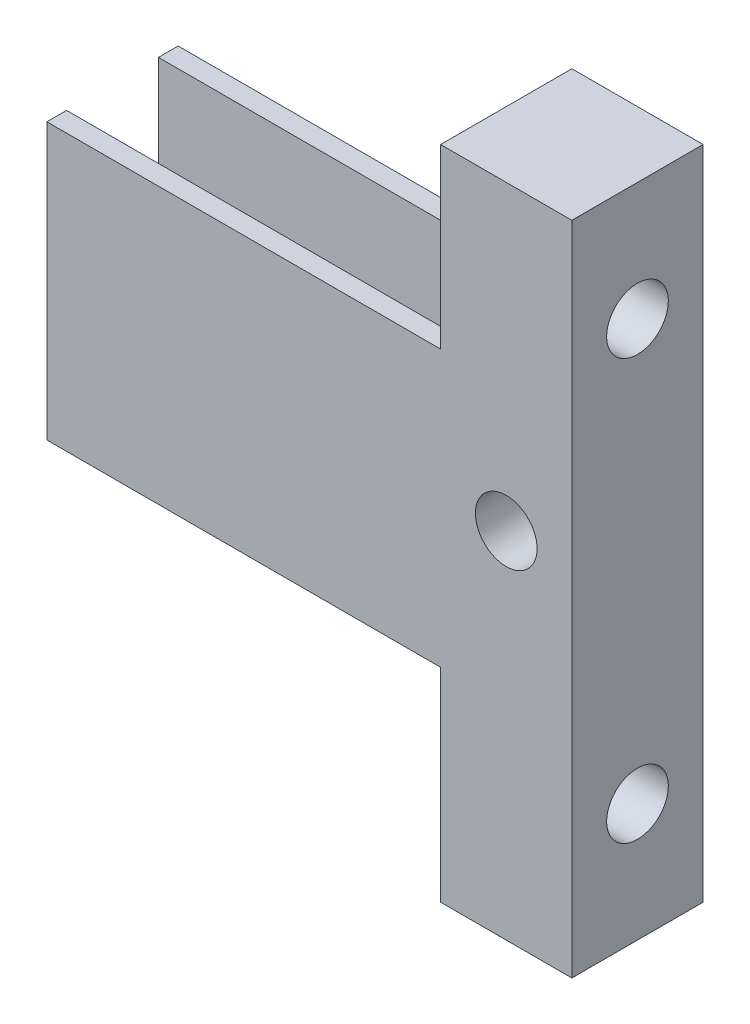
ISO-10303-21;
HEADER;
FILE_DESCRIPTION(('STEP AP214'),'2;1');
FILE_NAME('part.step','',(''),(''),'','','');
FILE_SCHEMA(('AUTOMOTIVE_DESIGN { 1 0 10303 214 1 1 1 1 }'));
ENDSEC;
DATA;
#1=APPLICATION_CONTEXT('core data for automotive mechanical design processes');
#2=APPLICATION_PROTOCOL_DEFINITION('international standard','automotive_design',2000,#1);
#3=PRODUCT_CONTEXT('',#1,'mechanical');
#4=PRODUCT('Part','Part','',(#3));
#5=PRODUCT_RELATED_PRODUCT_CATEGORY('part','',(#4));
#6=PRODUCT_DEFINITION_FORMATION('','',#4);
#7=PRODUCT_DEFINITION_CONTEXT('part definition',#1,'design');
#8=PRODUCT_DEFINITION('design','',#6,#7);
#9=PRODUCT_DEFINITION_SHAPE('','',#8);
#10=(LENGTH_UNIT() NAMED_UNIT(*) SI_UNIT(.MILLI.,.METRE.));
#11=(NAMED_UNIT(*) PLANE_ANGLE_UNIT() SI_UNIT($,.RADIAN.));
#12=(NAMED_UNIT(*) SI_UNIT($,.STERADIAN.) SOLID_ANGLE_UNIT());
#13=UNCERTAINTY_MEASURE_WITH_UNIT(LENGTH_MEASURE(1.E-05),#10,'distance_accuracy_value','');
#14=(GEOMETRIC_REPRESENTATION_CONTEXT(3) GLOBAL_UNCERTAINTY_ASSIGNED_CONTEXT((#13)) GLOBAL_UNIT_ASSIGNED_CONTEXT((#10,
#11,#12)) REPRESENTATION_CONTEXT('',''));
#15=CARTESIAN_POINT('',(0.,0.,0.));
#16=DIRECTION('',(0.,0.,1.));
#17=DIRECTION('',(1.,0.,0.));
#18=AXIS2_PLACEMENT_3D('',#15,#16,#17);
#19=CARTESIAN_POINT('',(0.,0.,10.));
#20=DIRECTION('',(-1.,0.,0.));
#21=DIRECTION('',(0.,-1.,0.));
#22=AXIS2_PLACEMENT_3D('',#19,#20,#21);
#23=PLANE('',#22);
#24=CARTESIAN_POINT('',(0.,41.,5.));
#25=DIRECTION('',(-1.,0.,0.));
#26=DIRECTION('',(0.,-1.,0.));
#27=AXIS2_PLACEMENT_3D('',#24,#25,#26);
#28=CIRCLE('',#27,2.35);
#29=CARTESIAN_POINT('',(0.,38.65,5.));
#30=VERTEX_POINT('',#29);
#31=EDGE_CURVE('E182',#30,#30,#28,.T.);
#32=ORIENTED_EDGE('',*,*,#31,.F.);
#33=EDGE_LOOP('',(#32));
#34=FACE_BOUND('',#33,.T.);
#35=CARTESIAN_POINT('',(0.,9.,5.));
#36=DIRECTION('',(-1.,0.,0.));
#37=DIRECTION('',(0.,-1.,0.));
#38=AXIS2_PLACEMENT_3D('',#35,#36,#37);
#39=CIRCLE('',#38,2.35);
#40=CARTESIAN_POINT('',(0.,6.65,5.));
#41=VERTEX_POINT('',#40);
#42=EDGE_CURVE('E177',#41,#41,#39,.T.);
#43=ORIENTED_EDGE('',*,*,#42,.F.);
#44=EDGE_LOOP('',(#43));
#45=FACE_BOUND('',#44,.T.);
#46=DIRECTION('',(0.,1.,0.));
#47=VECTOR('',#46,1.);
#48=CARTESIAN_POINT('',(0.,0.,0.));
#49=LINE('',#48,#47);
#50=CARTESIAN_POINT('',(0.,36.5,0.));
#51=VERTEX_POINT('',#50);
#52=CARTESIAN_POINT('',(0.,50.,0.));
#53=VERTEX_POINT('',#52);
#54=EDGE_CURVE('E213',#51,#53,#49,.T.);
#55=ORIENTED_EDGE('',*,*,#54,.F.);
#56=DIRECTION('',(0.,0.,-1.));
#57=VECTOR('',#56,1.);
#58=CARTESIAN_POINT('',(0.,36.5,0.));
#59=LINE('',#58,#57);
#60=CARTESIAN_POINT('',(0.,36.5,1.5));
#61=VERTEX_POINT('',#60);
#62=EDGE_CURVE('E50',#61,#51,#59,.T.);
#63=ORIENTED_EDGE('',*,*,#62,.F.);
#64=DIRECTION('',(0.,1.,0.));
#65=VECTOR('',#64,1.);
#66=CARTESIAN_POINT('',(0.,36.5,1.5));
#67=LINE('',#66,#65);
#68=CARTESIAN_POINT('',(0.,15.5,1.5));
#69=VERTEX_POINT('',#68);
#70=EDGE_CURVE('E142',#69,#61,#67,.T.);
#71=ORIENTED_EDGE('',*,*,#70,.F.);
#72=DIRECTION('',(0.,0.,1.));
#73=VECTOR('',#72,1.);
#74=CARTESIAN_POINT('',(0.,15.5,1.5));
#75=LINE('',#74,#73);
#76=CARTESIAN_POINT('',(0.,15.5,0.));
#77=VERTEX_POINT('',#76);
#78=EDGE_CURVE('E398',#77,#69,#75,.T.);
#79=ORIENTED_EDGE('',*,*,#78,.F.);
#80=CARTESIAN_POINT('',(0.,0.,0.));
#81=VERTEX_POINT('',#80);
#82=EDGE_CURVE('E214',#81,#77,#49,.T.);
#83=ORIENTED_EDGE('',*,*,#82,.F.);
#84=DIRECTION('',(0.,0.,-1.));
#85=VECTOR('',#84,1.);
#86=CARTESIAN_POINT('',(0.,0.,10.));
#87=LINE('',#86,#85);
#88=CARTESIAN_POINT('',(0.,0.,10.));
#89=VERTEX_POINT('',#88);
#90=EDGE_CURVE('E219',#89,#81,#87,.T.);
#91=ORIENTED_EDGE('',*,*,#90,.F.);
#92=DIRECTION('',(0.,1.,0.));
#93=VECTOR('',#92,1.);
#94=CARTESIAN_POINT('',(0.,0.,10.));
#95=LINE('',#94,#93);
#96=CARTESIAN_POINT('',(0.,15.5,10.));
#97=VERTEX_POINT('',#96);
#98=EDGE_CURVE('E204',#89,#97,#95,.T.);
#99=ORIENTED_EDGE('',*,*,#98,.T.);
#100=DIRECTION('',(0.,0.,1.));
#101=VECTOR('',#100,1.);
#102=CARTESIAN_POINT('',(0.,15.5,8.5));
#103=LINE('',#102,#101);
#104=CARTESIAN_POINT('',(0.,15.5,8.5));
#105=VERTEX_POINT('',#104);
#106=EDGE_CURVE('E157',#105,#97,#103,.T.);
#107=ORIENTED_EDGE('',*,*,#106,.F.);
#108=DIRECTION('',(0.,-1.,0.));
#109=VECTOR('',#108,1.);
#110=CARTESIAN_POINT('',(0.,36.5,8.5));
#111=LINE('',#110,#109);
#112=CARTESIAN_POINT('',(0.,36.5,8.5));
#113=VERTEX_POINT('',#112);
#114=EDGE_CURVE('E58',#113,#105,#111,.T.);
#115=ORIENTED_EDGE('',*,*,#114,.F.);
#116=DIRECTION('',(0.,0.,-1.));
#117=VECTOR('',#116,1.);
#118=CARTESIAN_POINT('',(0.,36.5,10.));
#119=LINE('',#118,#117);
#120=CARTESIAN_POINT('',(0.,36.5,10.));
#121=VERTEX_POINT('',#120);
#122=EDGE_CURVE('E145',#121,#113,#119,.T.);
#123=ORIENTED_EDGE('',*,*,#122,.F.);
#124=CARTESIAN_POINT('',(0.,50.,10.));
#125=VERTEX_POINT('',#124);
#126=EDGE_CURVE('E203',#121,#125,#95,.T.);
#127=ORIENTED_EDGE('',*,*,#126,.T.);
#128=DIRECTION('',(0.,0.,-1.));
#129=VECTOR('',#128,1.);
#130=CARTESIAN_POINT('',(0.,50.,10.));
#131=LINE('',#130,#129);
#132=EDGE_CURVE('E42',#125,#53,#131,.T.);
#133=ORIENTED_EDGE('',*,*,#132,.T.);
#134=EDGE_LOOP('',(#55,#63,#71,#79,#83,#91,#99,#107,#115,#123,#127,#133));
#135=FACE_BOUND('',#134,.T.);
#136=ADVANCED_FACE('F33',(#34,#45,#135),#23,.T.);
#137=CARTESIAN_POINT('',(9.99999999999999,50.,10.));
#138=DIRECTION('',(1.,0.,0.));
#139=DIRECTION('',(0.,1.,0.));
#140=AXIS2_PLACEMENT_3D('',#137,#138,#139);
#141=PLANE('',#140);
#142=CARTESIAN_POINT('',(10.,41.,5.));
#143=DIRECTION('',(-1.,0.,0.));
#144=DIRECTION('',(0.,-1.,0.));
#145=AXIS2_PLACEMENT_3D('',#142,#143,#144);
#146=CIRCLE('',#145,2.35);
#147=CARTESIAN_POINT('',(10.,38.65,5.));
#148=VERTEX_POINT('',#147);
#149=EDGE_CURVE('E178',#148,#148,#146,.T.);
#150=ORIENTED_EDGE('',*,*,#149,.T.);
#151=EDGE_LOOP('',(#150));
#152=FACE_BOUND('',#151,.T.);
#153=CARTESIAN_POINT('',(10.,9.,5.));
#154=DIRECTION('',(-1.,0.,0.));
#155=DIRECTION('',(0.,-1.,0.));
#156=AXIS2_PLACEMENT_3D('',#153,#154,#155);
#157=CIRCLE('',#156,2.35);
#158=CARTESIAN_POINT('',(10.,6.65,5.));
#159=VERTEX_POINT('',#158);
#160=EDGE_CURVE('E185',#159,#159,#157,.T.);
#161=ORIENTED_EDGE('',*,*,#160,.T.);
#162=EDGE_LOOP('',(#161));
#163=FACE_BOUND('',#162,.T.);
#164=DIRECTION('',(0.,-1.,0.));
#165=VECTOR('',#164,1.);
#166=CARTESIAN_POINT('',(9.99999999999999,50.,0.));
#167=LINE('',#166,#165);
#168=CARTESIAN_POINT('',(9.99999999999999,50.,0.));
#169=VERTEX_POINT('',#168);
#170=CARTESIAN_POINT('',(10.,0.,0.));
#171=VERTEX_POINT('',#170);
#172=EDGE_CURVE('E193',#169,#171,#167,.T.);
#173=ORIENTED_EDGE('',*,*,#172,.F.);
#174=DIRECTION('',(0.,0.,-1.));
#175=VECTOR('',#174,1.);
#176=CARTESIAN_POINT('',(9.99999999999999,50.,10.));
#177=LINE('',#176,#175);
#178=CARTESIAN_POINT('',(9.99999999999999,50.,10.));
#179=VERTEX_POINT('',#178);
#180=EDGE_CURVE('E11',#179,#169,#177,.T.);
#181=ORIENTED_EDGE('',*,*,#180,.F.);
#182=DIRECTION('',(0.,-1.,0.));
#183=VECTOR('',#182,1.);
#184=CARTESIAN_POINT('',(9.99999999999999,50.,10.));
#185=LINE('',#184,#183);
#186=CARTESIAN_POINT('',(10.,0.,10.));
#187=VERTEX_POINT('',#186);
#188=EDGE_CURVE('E196',#179,#187,#185,.T.);
#189=ORIENTED_EDGE('',*,*,#188,.T.);
#190=DIRECTION('',(0.,0.,-1.));
#191=VECTOR('',#190,1.);
#192=CARTESIAN_POINT('',(10.,0.,10.));
#193=LINE('',#192,#191);
#194=EDGE_CURVE('E37',#187,#171,#193,.T.);
#195=ORIENTED_EDGE('',*,*,#194,.T.);
#196=EDGE_LOOP('',(#173,#181,#189,#195));
#197=FACE_BOUND('',#196,.T.);
#198=ADVANCED_FACE('F35',(#152,#163,#197),#141,.T.);
#199=CARTESIAN_POINT('',(0.,50.,10.));
#200=DIRECTION('',(0.,1.,0.));
#201=DIRECTION('',(0.,0.,1.));
#202=AXIS2_PLACEMENT_3D('',#199,#200,#201);
#203=PLANE('',#202);
#204=DIRECTION('',(1.,0.,0.));
#205=VECTOR('',#204,1.);
#206=CARTESIAN_POINT('',(0.,50.,0.));
#207=LINE('',#206,#205);
#208=EDGE_CURVE('E200',#53,#169,#207,.T.);
#209=ORIENTED_EDGE('',*,*,#208,.F.);
#210=ORIENTED_EDGE('',*,*,#132,.F.);
#211=DIRECTION('',(1.,0.,0.));
#212=VECTOR('',#211,1.);
#213=CARTESIAN_POINT('',(0.,50.,10.));
#214=LINE('',#213,#212);
#215=EDGE_CURVE('E206',#125,#179,#214,.T.);
#216=ORIENTED_EDGE('',*,*,#215,.T.);
#217=ORIENTED_EDGE('',*,*,#180,.T.);
#218=EDGE_LOOP('',(#209,#210,#216,#217));
#219=FACE_BOUND('',#218,.T.);
#220=ADVANCED_FACE('F231',(#219),#203,.T.);
#221=CARTESIAN_POINT('',(10.,0.,10.));
#222=DIRECTION('',(0.,-1.,0.));
#223=DIRECTION('',(1.,0.,0.));
#224=AXIS2_PLACEMENT_3D('',#221,#222,#223);
#225=PLANE('',#224);
#226=DIRECTION('',(-1.,0.,0.));
#227=VECTOR('',#226,1.);
#228=CARTESIAN_POINT('',(10.,0.,0.));
#229=LINE('',#228,#227);
#230=EDGE_CURVE('E210',#171,#81,#229,.T.);
#231=ORIENTED_EDGE('',*,*,#230,.F.);
#232=ORIENTED_EDGE('',*,*,#194,.F.);
#233=DIRECTION('',(-1.,0.,0.));
#234=VECTOR('',#233,1.);
#235=CARTESIAN_POINT('',(10.,0.,10.));
#236=LINE('',#235,#234);
#237=EDGE_CURVE('E199',#187,#89,#236,.T.);
#238=ORIENTED_EDGE('',*,*,#237,.T.);
#239=ORIENTED_EDGE('',*,*,#90,.T.);
#240=EDGE_LOOP('',(#231,#232,#238,#239));
#241=FACE_BOUND('',#240,.T.);
#242=ADVANCED_FACE('F227',(#241),#225,.T.);
#243=CARTESIAN_POINT('',(0.,0.,10.));
#244=DIRECTION('',(0.,0.,-1.));
#245=DIRECTION('',(-1.,0.,0.));
#246=AXIS2_PLACEMENT_3D('',#243,#244,#245);
#247=PLANE('',#246);
#248=CARTESIAN_POINT('',(4.99999999999999,27.,10.));
#249=DIRECTION('',(0.,0.,1.));
#250=DIRECTION('',(1.,0.,0.));
#251=AXIS2_PLACEMENT_3D('',#248,#249,#250);
#252=CIRCLE('',#251,2.35);
#253=CARTESIAN_POINT('',(7.34999999999999,27.,10.));
#254=VERTEX_POINT('',#253);
#255=EDGE_CURVE('E181',#254,#254,#252,.T.);
#256=ORIENTED_EDGE('',*,*,#255,.F.);
#257=EDGE_LOOP('',(#256));
#258=FACE_BOUND('',#257,.T.);
#259=ORIENTED_EDGE('',*,*,#188,.F.);
#260=ORIENTED_EDGE('',*,*,#215,.F.);
#261=ORIENTED_EDGE('',*,*,#126,.F.);
#262=DIRECTION('',(1.,0.,0.));
#263=VECTOR('',#262,1.);
#264=CARTESIAN_POINT('',(-30.,36.5,10.));
#265=LINE('',#264,#263);
#266=CARTESIAN_POINT('',(-30.,36.5,10.));
#267=VERTEX_POINT('',#266);
#268=EDGE_CURVE('E162',#267,#121,#265,.T.);
#269=ORIENTED_EDGE('',*,*,#268,.F.);
#270=DIRECTION('',(0.,1.,0.));
#271=VECTOR('',#270,1.);
#272=CARTESIAN_POINT('',(-30.,15.5,10.));
#273=LINE('',#272,#271);
#274=CARTESIAN_POINT('',(-30.,15.5,10.));
#275=VERTEX_POINT('',#274);
#276=EDGE_CURVE('E161',#275,#267,#273,.T.);
#277=ORIENTED_EDGE('',*,*,#276,.F.);
#278=DIRECTION('',(1.,0.,0.));
#279=VECTOR('',#278,1.);
#280=CARTESIAN_POINT('',(-30.,15.5,10.));
#281=LINE('',#280,#279);
#282=EDGE_CURVE('E169',#275,#97,#281,.T.);
#283=ORIENTED_EDGE('',*,*,#282,.T.);
#284=ORIENTED_EDGE('',*,*,#98,.F.);
#285=ORIENTED_EDGE('',*,*,#237,.F.);
#286=EDGE_LOOP('',(#259,#260,#261,#269,#277,#283,#284,#285));
#287=FACE_BOUND('',#286,.T.);
#288=ADVANCED_FACE('F234',(#258,#287),#247,.F.);
#289=CARTESIAN_POINT('',(0.,0.,0.));
#290=DIRECTION('',(0.,0.,-1.));
#291=DIRECTION('',(-1.,0.,0.));
#292=AXIS2_PLACEMENT_3D('',#289,#290,#291);
#293=PLANE('',#292);
#294=CARTESIAN_POINT('',(4.99999999999999,27.,0.));
#295=DIRECTION('',(0.,0.,1.));
#296=DIRECTION('',(1.,0.,0.));
#297=AXIS2_PLACEMENT_3D('',#294,#295,#296);
#298=CIRCLE('',#297,2.35);
#299=CARTESIAN_POINT('',(7.34999999999999,27.,0.));
#300=VERTEX_POINT('',#299);
#301=EDGE_CURVE('E190',#300,#300,#298,.T.);
#302=ORIENTED_EDGE('',*,*,#301,.T.);
#303=EDGE_LOOP('',(#302));
#304=FACE_BOUND('',#303,.T.);
#305=ORIENTED_EDGE('',*,*,#172,.T.);
#306=ORIENTED_EDGE('',*,*,#230,.T.);
#307=ORIENTED_EDGE('',*,*,#82,.T.);
#308=DIRECTION('',(1.,0.,0.));
#309=VECTOR('',#308,1.);
#310=CARTESIAN_POINT('',(-30.,15.5,0.));
#311=LINE('',#310,#309);
#312=CARTESIAN_POINT('',(-30.,15.5,0.));
#313=VERTEX_POINT('',#312);
#314=EDGE_CURVE('E131',#313,#77,#311,.T.);
#315=ORIENTED_EDGE('',*,*,#314,.F.);
#316=DIRECTION('',(0.,-1.,0.));
#317=VECTOR('',#316,1.);
#318=CARTESIAN_POINT('',(-30.,15.5,0.));
#319=LINE('',#318,#317);
#320=CARTESIAN_POINT('',(-30.,36.5,0.));
#321=VERTEX_POINT('',#320);
#322=EDGE_CURVE('E124',#321,#313,#319,.T.);
#323=ORIENTED_EDGE('',*,*,#322,.F.);
#324=DIRECTION('',(1.,0.,0.));
#325=VECTOR('',#324,1.);
#326=CARTESIAN_POINT('',(-30.,36.5,0.));
#327=LINE('',#326,#325);
#328=EDGE_CURVE('E128',#321,#51,#327,.T.);
#329=ORIENTED_EDGE('',*,*,#328,.T.);
#330=ORIENTED_EDGE('',*,*,#54,.T.);
#331=ORIENTED_EDGE('',*,*,#208,.T.);
#332=EDGE_LOOP('',(#305,#306,#307,#315,#323,#329,#330,#331));
#333=FACE_BOUND('',#332,.T.);
#334=ADVANCED_FACE('F127',(#304,#333),#293,.T.);
#335=CARTESIAN_POINT('',(4.99999999999999,27.,0.));
#336=DIRECTION('',(0.,0.,1.));
#337=DIRECTION('',(1.,0.,0.));
#338=AXIS2_PLACEMENT_3D('',#335,#336,#337);
#339=CYLINDRICAL_SURFACE('',#338,2.35);
#340=ORIENTED_EDGE('',*,*,#301,.F.);
#341=EDGE_LOOP('',(#340));
#342=FACE_BOUND('',#341,.T.);
#343=ORIENTED_EDGE('',*,*,#255,.T.);
#344=EDGE_LOOP('',(#343));
#345=FACE_BOUND('',#344,.T.);
#346=ADVANCED_FACE('F291',(#342,#345),#339,.F.);
#347=CARTESIAN_POINT('',(10.,9.,5.));
#348=DIRECTION('',(-1.,0.,0.));
#349=DIRECTION('',(0.,-1.,0.));
#350=AXIS2_PLACEMENT_3D('',#347,#348,#349);
#351=CYLINDRICAL_SURFACE('',#350,2.35);
#352=ORIENTED_EDGE('',*,*,#160,.F.);
#353=EDGE_LOOP('',(#352));
#354=FACE_BOUND('',#353,.T.);
#355=ORIENTED_EDGE('',*,*,#42,.T.);
#356=EDGE_LOOP('',(#355));
#357=FACE_BOUND('',#356,.T.);
#358=ADVANCED_FACE('F295',(#354,#357),#351,.F.);
#359=CARTESIAN_POINT('',(10.,41.,5.));
#360=DIRECTION('',(-1.,0.,0.));
#361=DIRECTION('',(0.,-1.,0.));
#362=AXIS2_PLACEMENT_3D('',#359,#360,#361);
#363=CYLINDRICAL_SURFACE('',#362,2.35);
#364=ORIENTED_EDGE('',*,*,#149,.F.);
#365=EDGE_LOOP('',(#364));
#366=FACE_BOUND('',#365,.T.);
#367=ORIENTED_EDGE('',*,*,#31,.T.);
#368=EDGE_LOOP('',(#367));
#369=FACE_BOUND('',#368,.T.);
#370=ADVANCED_FACE('F300',(#366,#369),#363,.F.);
#371=CARTESIAN_POINT('',(-30.,36.5,10.));
#372=DIRECTION('',(0.,-1.,0.));
#373=DIRECTION('',(1.,0.,0.));
#374=AXIS2_PLACEMENT_3D('',#371,#372,#373);
#375=PLANE('',#374);
#376=ORIENTED_EDGE('',*,*,#122,.T.);
#377=DIRECTION('',(1.,0.,0.));
#378=VECTOR('',#377,1.);
#379=CARTESIAN_POINT('',(-30.,36.5,8.5));
#380=LINE('',#379,#378);
#381=CARTESIAN_POINT('',(-30.,36.5,8.5));
#382=VERTEX_POINT('',#381);
#383=EDGE_CURVE('E175',#382,#113,#380,.T.);
#384=ORIENTED_EDGE('',*,*,#383,.F.);
#385=DIRECTION('',(0.,0.,-1.));
#386=VECTOR('',#385,1.);
#387=CARTESIAN_POINT('',(-30.,36.5,10.));
#388=LINE('',#387,#386);
#389=EDGE_CURVE('E153',#267,#382,#388,.T.);
#390=ORIENTED_EDGE('',*,*,#389,.F.);
#391=ORIENTED_EDGE('',*,*,#268,.T.);
#392=EDGE_LOOP('',(#376,#384,#390,#391));
#393=FACE_BOUND('',#392,.T.);
#394=ADVANCED_FACE('F248',(#393),#375,.F.);
#395=CARTESIAN_POINT('',(-30.,36.5,8.5));
#396=DIRECTION('',(0.,0.,1.));
#397=DIRECTION('',(0.,-1.,0.));
#398=AXIS2_PLACEMENT_3D('',#395,#396,#397);
#399=PLANE('',#398);
#400=ORIENTED_EDGE('',*,*,#114,.T.);
#401=DIRECTION('',(1.,0.,0.));
#402=VECTOR('',#401,1.);
#403=CARTESIAN_POINT('',(-30.,15.5,8.5));
#404=LINE('',#403,#402);
#405=CARTESIAN_POINT('',(-30.,15.5,8.5));
#406=VERTEX_POINT('',#405);
#407=EDGE_CURVE('E172',#406,#105,#404,.T.);
#408=ORIENTED_EDGE('',*,*,#407,.F.);
#409=DIRECTION('',(0.,-1.,0.));
#410=VECTOR('',#409,1.);
#411=CARTESIAN_POINT('',(-30.,36.5,8.5));
#412=LINE('',#411,#410);
#413=EDGE_CURVE('E156',#382,#406,#412,.T.);
#414=ORIENTED_EDGE('',*,*,#413,.F.);
#415=ORIENTED_EDGE('',*,*,#383,.T.);
#416=EDGE_LOOP('',(#400,#408,#414,#415));
#417=FACE_BOUND('',#416,.T.);
#418=ADVANCED_FACE('F244',(#417),#399,.F.);
#419=CARTESIAN_POINT('',(-30.,15.5,8.5));
#420=DIRECTION('',(0.,1.,0.));
#421=DIRECTION('',(0.,0.,1.));
#422=AXIS2_PLACEMENT_3D('',#419,#420,#421);
#423=PLANE('',#422);
#424=ORIENTED_EDGE('',*,*,#106,.T.);
#425=ORIENTED_EDGE('',*,*,#282,.F.);
#426=DIRECTION('',(0.,0.,1.));
#427=VECTOR('',#426,1.);
#428=CARTESIAN_POINT('',(-30.,15.5,8.5));
#429=LINE('',#428,#427);
#430=EDGE_CURVE('E159',#406,#275,#429,.T.);
#431=ORIENTED_EDGE('',*,*,#430,.F.);
#432=ORIENTED_EDGE('',*,*,#407,.T.);
#433=EDGE_LOOP('',(#424,#425,#431,#432));
#434=FACE_BOUND('',#433,.T.);
#435=ADVANCED_FACE('F240',(#434),#423,.F.);
#436=CARTESIAN_POINT('',(-30.,0.,0.));
#437=DIRECTION('',(-1.,0.,0.));
#438=DIRECTION('',(0.,-1.,0.));
#439=AXIS2_PLACEMENT_3D('',#436,#437,#438);
#440=PLANE('',#439);
#441=ORIENTED_EDGE('',*,*,#389,.T.);
#442=ORIENTED_EDGE('',*,*,#413,.T.);
#443=ORIENTED_EDGE('',*,*,#430,.T.);
#444=ORIENTED_EDGE('',*,*,#276,.T.);
#445=EDGE_LOOP('',(#441,#442,#443,#444));
#446=FACE_BOUND('',#445,.T.);
#447=ADVANCED_FACE('F251',(#446),#440,.T.);
#448=CARTESIAN_POINT('',(-30.,36.5,0.));
#449=DIRECTION('',(0.,-1.,0.));
#450=DIRECTION('',(1.,0.,0.));
#451=AXIS2_PLACEMENT_3D('',#448,#449,#450);
#452=PLANE('',#451);
#453=ORIENTED_EDGE('',*,*,#62,.T.);
#454=ORIENTED_EDGE('',*,*,#328,.F.);
#455=DIRECTION('',(0.,0.,-1.));
#456=VECTOR('',#455,1.);
#457=CARTESIAN_POINT('',(-30.,36.5,0.));
#458=LINE('',#457,#456);
#459=CARTESIAN_POINT('',(-30.,36.5,1.5));
#460=VERTEX_POINT('',#459);
#461=EDGE_CURVE('E135',#460,#321,#458,.T.);
#462=ORIENTED_EDGE('',*,*,#461,.F.);
#463=DIRECTION('',(1.,0.,0.));
#464=VECTOR('',#463,1.);
#465=CARTESIAN_POINT('',(-30.,36.5,1.5));
#466=LINE('',#465,#464);
#467=EDGE_CURVE('E395',#460,#61,#466,.T.);
#468=ORIENTED_EDGE('',*,*,#467,.T.);
#469=EDGE_LOOP('',(#453,#454,#462,#468));
#470=FACE_BOUND('',#469,.T.);
#471=ADVANCED_FACE('F144',(#470),#452,.F.);
#472=CARTESIAN_POINT('',(-30.,15.5,1.5));
#473=DIRECTION('',(0.,1.,0.));
#474=DIRECTION('',(-1.,0.,0.));
#475=AXIS2_PLACEMENT_3D('',#472,#473,#474);
#476=PLANE('',#475);
#477=ORIENTED_EDGE('',*,*,#78,.T.);
#478=DIRECTION('',(1.,0.,0.));
#479=VECTOR('',#478,1.);
#480=CARTESIAN_POINT('',(-30.,15.5,1.5));
#481=LINE('',#480,#479);
#482=CARTESIAN_POINT('',(-30.,15.5,1.5));
#483=VERTEX_POINT('',#482);
#484=EDGE_CURVE('E149',#483,#69,#481,.T.);
#485=ORIENTED_EDGE('',*,*,#484,.F.);
#486=DIRECTION('',(0.,0.,1.));
#487=VECTOR('',#486,1.);
#488=CARTESIAN_POINT('',(-30.,15.5,1.5));
#489=LINE('',#488,#487);
#490=EDGE_CURVE('E134',#313,#483,#489,.T.);
#491=ORIENTED_EDGE('',*,*,#490,.F.);
#492=ORIENTED_EDGE('',*,*,#314,.T.);
#493=EDGE_LOOP('',(#477,#485,#491,#492));
#494=FACE_BOUND('',#493,.T.);
#495=ADVANCED_FACE('F258',(#494),#476,.F.);
#496=CARTESIAN_POINT('',(-30.,36.5,1.5));
#497=DIRECTION('',(0.,0.,-1.));
#498=DIRECTION('',(0.,1.,0.));
#499=AXIS2_PLACEMENT_3D('',#496,#497,#498);
#500=PLANE('',#499);
#501=ORIENTED_EDGE('',*,*,#70,.T.);
#502=ORIENTED_EDGE('',*,*,#467,.F.);
#503=DIRECTION('',(0.,1.,0.));
#504=VECTOR('',#503,1.);
#505=CARTESIAN_POINT('',(-30.,36.5,1.5));
#506=LINE('',#505,#504);
#507=EDGE_CURVE('E140',#483,#460,#506,.T.);
#508=ORIENTED_EDGE('',*,*,#507,.F.);
#509=ORIENTED_EDGE('',*,*,#484,.T.);
#510=EDGE_LOOP('',(#501,#502,#508,#509));
#511=FACE_BOUND('',#510,.T.);
#512=ADVANCED_FACE('F371',(#511),#500,.F.);
#513=CARTESIAN_POINT('',(-30.,0.,0.));
#514=DIRECTION('',(1.,0.,0.));
#515=DIRECTION('',(0.,1.,0.));
#516=AXIS2_PLACEMENT_3D('',#513,#514,#515);
#517=PLANE('',#516);
#518=ORIENTED_EDGE('',*,*,#461,.T.);
#519=ORIENTED_EDGE('',*,*,#322,.T.);
#520=ORIENTED_EDGE('',*,*,#490,.T.);
#521=ORIENTED_EDGE('',*,*,#507,.T.);
#522=EDGE_LOOP('',(#518,#519,#520,#521));
#523=FACE_BOUND('',#522,.T.);
#524=ADVANCED_FACE('F138',(#523),#517,.F.);
#525=CLOSED_SHELL('',(#136,#198,#220,#242,#288,#334,#346,#358,#370,#394,#418,#435,#447,#471,
#495,#512,#524));
#526=MANIFOLD_SOLID_BREP('B2',#525);
#527=ADVANCED_BREP_SHAPE_REPRESENTATION('',(#18,#526),#14);
#528=SHAPE_DEFINITION_REPRESENTATION(#9,#527);
ENDSEC;
END-ISO-10303-21;
